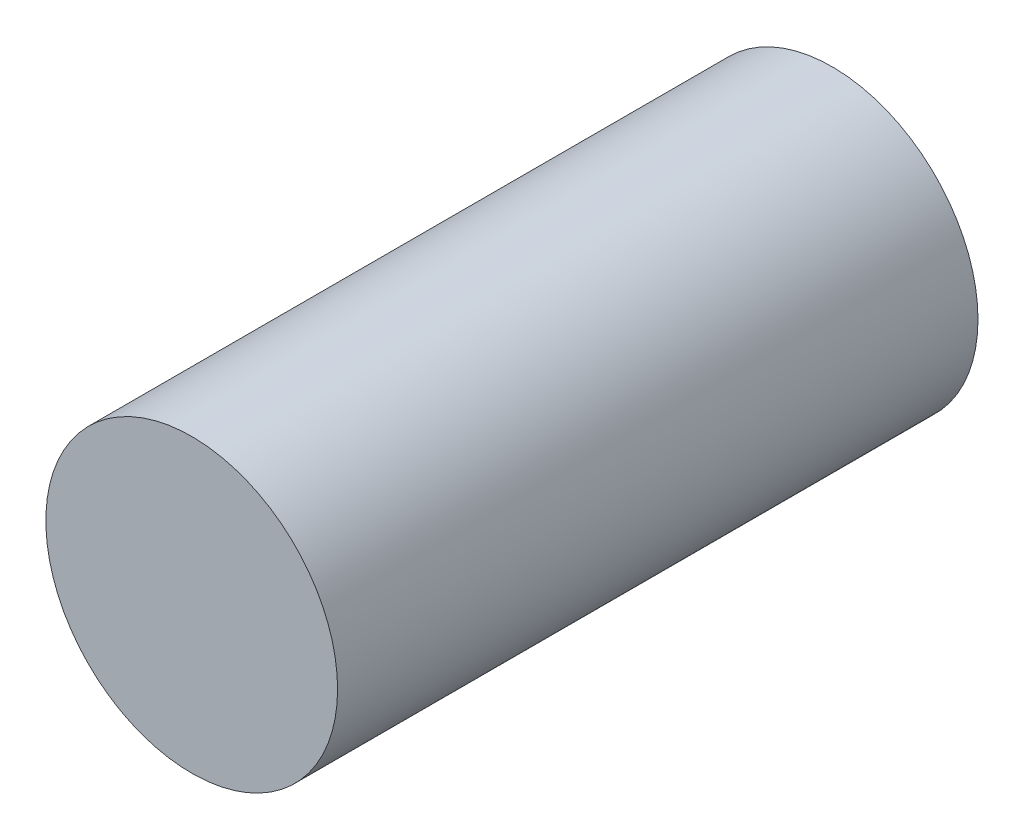
ISO-10303-21;
HEADER;
FILE_DESCRIPTION(('STEP AP214'),'2;1');
FILE_NAME('part.step','',(''),(''),'','','');
FILE_SCHEMA(('AUTOMOTIVE_DESIGN { 1 0 10303 214 1 1 1 1 }'));
ENDSEC;
DATA;
#1=APPLICATION_CONTEXT('core data for automotive mechanical design processes');
#2=APPLICATION_PROTOCOL_DEFINITION('international standard','automotive_design',2000,#1);
#3=PRODUCT_CONTEXT('',#1,'mechanical');
#4=PRODUCT('Part','Part','',(#3));
#5=PRODUCT_RELATED_PRODUCT_CATEGORY('part','',(#4));
#6=PRODUCT_DEFINITION_FORMATION('','',#4);
#7=PRODUCT_DEFINITION_CONTEXT('part definition',#1,'design');
#8=PRODUCT_DEFINITION('design','',#6,#7);
#9=PRODUCT_DEFINITION_SHAPE('','',#8);
#10=(LENGTH_UNIT() NAMED_UNIT(*) SI_UNIT(.MILLI.,.METRE.));
#11=(NAMED_UNIT(*) PLANE_ANGLE_UNIT() SI_UNIT($,.RADIAN.));
#12=(NAMED_UNIT(*) SI_UNIT($,.STERADIAN.) SOLID_ANGLE_UNIT());
#13=UNCERTAINTY_MEASURE_WITH_UNIT(LENGTH_MEASURE(1.E-05),#10,'distance_accuracy_value','');
#14=(GEOMETRIC_REPRESENTATION_CONTEXT(3) GLOBAL_UNCERTAINTY_ASSIGNED_CONTEXT((#13)) GLOBAL_UNIT_ASSIGNED_CONTEXT((#10,
#11,#12)) REPRESENTATION_CONTEXT('',''));
#15=CARTESIAN_POINT('',(0.,0.,0.));
#16=DIRECTION('',(0.,0.,1.));
#17=DIRECTION('',(1.,0.,0.));
#18=AXIS2_PLACEMENT_3D('',#15,#16,#17);
#19=CARTESIAN_POINT('',(5.08,1.27,0.1));
#20=DIRECTION('',(0.,0.,1.));
#21=DIRECTION('',(1.,0.,0.));
#22=AXIS2_PLACEMENT_3D('',#19,#20,#21);
#23=PLANE('',#22);
#24=CARTESIAN_POINT('',(5.08,1.27,0.1));
#25=DIRECTION('',(0.,0.,1.));
#26=DIRECTION('',(1.,0.,0.));
#27=AXIS2_PLACEMENT_3D('',#24,#25,#26);
#28=CIRCLE('',#27,0.41);
#29=CARTESIAN_POINT('',(5.49,1.27,0.1));
#30=VERTEX_POINT('',#29);
#31=EDGE_CURVE('E17',#30,#30,#28,.F.);
#32=ORIENTED_EDGE('',*,*,#31,.F.);
#33=EDGE_LOOP('',(#32));
#34=FACE_BOUND('',#33,.T.);
#35=ADVANCED_FACE('F14',(#34),#23,.T.);
#36=CARTESIAN_POINT('',(5.08,1.27,-1.7));
#37=DIRECTION('',(0.,0.,1.));
#38=DIRECTION('',(1.,0.,0.));
#39=AXIS2_PLACEMENT_3D('',#36,#37,#38);
#40=PLANE('',#39);
#41=CARTESIAN_POINT('',(5.08,1.27,-1.7));
#42=DIRECTION('',(0.,0.,1.));
#43=DIRECTION('',(1.,0.,0.));
#44=AXIS2_PLACEMENT_3D('',#41,#42,#43);
#45=CIRCLE('',#44,0.41);
#46=CARTESIAN_POINT('',(5.49,1.27,-1.7));
#47=VERTEX_POINT('',#46);
#48=EDGE_CURVE('E10',#47,#47,#45,.T.);
#49=ORIENTED_EDGE('',*,*,#48,.F.);
#50=EDGE_LOOP('',(#49));
#51=FACE_BOUND('',#50,.T.);
#52=ADVANCED_FACE('F29',(#51),#40,.F.);
#53=CARTESIAN_POINT('',(5.08,1.27,-1.7));
#54=DIRECTION('',(0.,0.,1.));
#55=DIRECTION('',(1.,0.,0.));
#56=AXIS2_PLACEMENT_3D('',#53,#54,#55);
#57=CYLINDRICAL_SURFACE('',#56,0.41);
#58=ORIENTED_EDGE('',*,*,#48,.T.);
#59=EDGE_LOOP('',(#58));
#60=FACE_BOUND('',#59,.T.);
#61=ORIENTED_EDGE('',*,*,#31,.T.);
#62=EDGE_LOOP('',(#61));
#63=FACE_BOUND('',#62,.T.);
#64=ADVANCED_FACE('F26',(#60,#63),#57,.T.);
#65=CLOSED_SHELL('',(#35,#52,#64));
#66=MANIFOLD_SOLID_BREP('B1',#65);
#67=ADVANCED_BREP_SHAPE_REPRESENTATION('',(#18,#66),#14);
#68=SHAPE_DEFINITION_REPRESENTATION(#9,#67);
ENDSEC;
END-ISO-10303-21;
